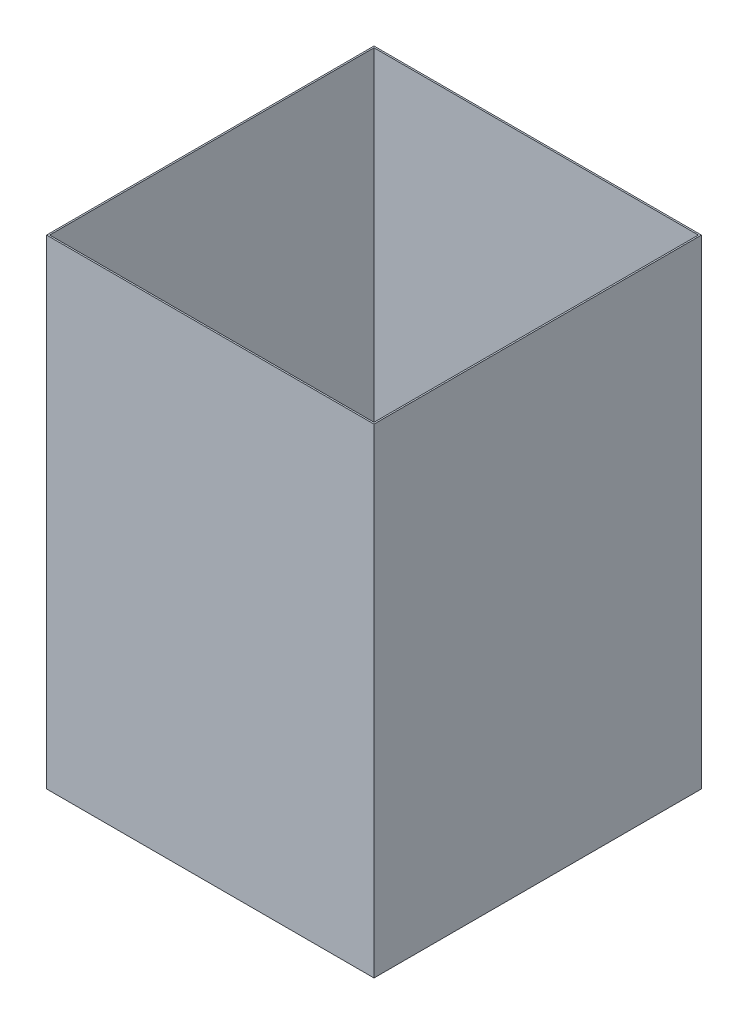
ISO-10303-21;
HEADER;
FILE_DESCRIPTION(('STEP AP214'),'2;1');
FILE_NAME('part.step','',(''),(''),'','','');
FILE_SCHEMA(('AUTOMOTIVE_DESIGN { 1 0 10303 214 1 1 1 1 }'));
ENDSEC;
DATA;
#1=APPLICATION_CONTEXT('core data for automotive mechanical design processes');
#2=APPLICATION_PROTOCOL_DEFINITION('international standard','automotive_design',2000,#1);
#3=PRODUCT_CONTEXT('',#1,'mechanical');
#4=PRODUCT('Part','Part','',(#3));
#5=PRODUCT_RELATED_PRODUCT_CATEGORY('part','',(#4));
#6=PRODUCT_DEFINITION_FORMATION('','',#4);
#7=PRODUCT_DEFINITION_CONTEXT('part definition',#1,'design');
#8=PRODUCT_DEFINITION('design','',#6,#7);
#9=PRODUCT_DEFINITION_SHAPE('','',#8);
#10=(LENGTH_UNIT() NAMED_UNIT(*) SI_UNIT(.MILLI.,.METRE.));
#11=(NAMED_UNIT(*) PLANE_ANGLE_UNIT() SI_UNIT($,.RADIAN.));
#12=(NAMED_UNIT(*) SI_UNIT($,.STERADIAN.) SOLID_ANGLE_UNIT());
#13=UNCERTAINTY_MEASURE_WITH_UNIT(LENGTH_MEASURE(1.E-05),#10,'distance_accuracy_value','');
#14=(GEOMETRIC_REPRESENTATION_CONTEXT(3) GLOBAL_UNCERTAINTY_ASSIGNED_CONTEXT((#13)) GLOBAL_UNIT_ASSIGNED_CONTEXT((#10,
#11,#12)) REPRESENTATION_CONTEXT('',''));
#15=CARTESIAN_POINT('',(0.,0.,0.));
#16=DIRECTION('',(0.,0.,1.));
#17=DIRECTION('',(1.,0.,0.));
#18=AXIS2_PLACEMENT_3D('',#15,#16,#17);
#19=CARTESIAN_POINT('',(0.,630.,0.));
#20=DIRECTION('',(0.,-1.,0.));
#21=DIRECTION('',(0.,0.,-1.));
#22=AXIS2_PLACEMENT_3D('',#19,#20,#21);
#23=PLANE('',#22);
#24=DIRECTION('',(0.,0.,-1.));
#25=VECTOR('',#24,1.);
#26=CARTESIAN_POINT('',(215.,630.,215.));
#27=LINE('',#26,#25);
#28=CARTESIAN_POINT('',(215.,630.,215.));
#29=VERTEX_POINT('',#28);
#30=CARTESIAN_POINT('',(215.,630.,-215.));
#31=VERTEX_POINT('',#30);
#32=EDGE_CURVE('E145',#29,#31,#27,.T.);
#33=ORIENTED_EDGE('',*,*,#32,.T.);
#34=DIRECTION('',(-1.,0.,0.));
#35=VECTOR('',#34,1.);
#36=CARTESIAN_POINT('',(-215.,630.,-215.));
#37=LINE('',#36,#35);
#38=CARTESIAN_POINT('',(-215.,630.,-215.));
#39=VERTEX_POINT('',#38);
#40=EDGE_CURVE('E89',#31,#39,#37,.T.);
#41=ORIENTED_EDGE('',*,*,#40,.T.);
#42=DIRECTION('',(0.,0.,1.));
#43=VECTOR('',#42,1.);
#44=CARTESIAN_POINT('',(-215.,630.,215.));
#45=LINE('',#44,#43);
#46=CARTESIAN_POINT('',(-215.,630.,215.));
#47=VERTEX_POINT('',#46);
#48=EDGE_CURVE('E148',#39,#47,#45,.T.);
#49=ORIENTED_EDGE('',*,*,#48,.T.);
#50=DIRECTION('',(1.,0.,0.));
#51=VECTOR('',#50,1.);
#52=CARTESIAN_POINT('',(-215.,630.,215.));
#53=LINE('',#52,#51);
#54=EDGE_CURVE('E61',#47,#29,#53,.T.);
#55=ORIENTED_EDGE('',*,*,#54,.T.);
#56=EDGE_LOOP('',(#33,#41,#49,#55));
#57=FACE_BOUND('',#56,.T.);
#58=DIRECTION('',(0.,0.,-1.));
#59=VECTOR('',#58,1.);
#60=CARTESIAN_POINT('',(213.,630.,0.));
#61=LINE('',#60,#59);
#62=CARTESIAN_POINT('',(213.,630.,213.));
#63=VERTEX_POINT('',#62);
#64=CARTESIAN_POINT('',(213.,630.,-213.));
#65=VERTEX_POINT('',#64);
#66=EDGE_CURVE('E134',#63,#65,#61,.T.);
#67=ORIENTED_EDGE('',*,*,#66,.F.);
#68=DIRECTION('',(1.,0.,0.));
#69=VECTOR('',#68,1.);
#70=CARTESIAN_POINT('',(0.,630.,213.));
#71=LINE('',#70,#69);
#72=CARTESIAN_POINT('',(-213.,630.,213.));
#73=VERTEX_POINT('',#72);
#74=EDGE_CURVE('E143',#73,#63,#71,.T.);
#75=ORIENTED_EDGE('',*,*,#74,.F.);
#76=DIRECTION('',(0.,0.,1.));
#77=VECTOR('',#76,1.);
#78=CARTESIAN_POINT('',(-213.,630.,0.));
#79=LINE('',#78,#77);
#80=CARTESIAN_POINT('',(-213.,630.,-213.));
#81=VERTEX_POINT('',#80);
#82=EDGE_CURVE('E141',#81,#73,#79,.T.);
#83=ORIENTED_EDGE('',*,*,#82,.F.);
#84=DIRECTION('',(-1.,0.,0.));
#85=VECTOR('',#84,1.);
#86=CARTESIAN_POINT('',(0.,630.,-213.));
#87=LINE('',#86,#85);
#88=EDGE_CURVE('E126',#65,#81,#87,.T.);
#89=ORIENTED_EDGE('',*,*,#88,.F.);
#90=EDGE_LOOP('',(#67,#75,#83,#89));
#91=FACE_BOUND('',#90,.T.);
#92=ADVANCED_FACE('F35',(#57,#91),#23,.F.);
#93=CARTESIAN_POINT('',(215.,630.,215.));
#94=DIRECTION('',(-1.,0.,0.));
#95=DIRECTION('',(0.,0.,1.));
#96=AXIS2_PLACEMENT_3D('',#93,#94,#95);
#97=PLANE('',#96);
#98=DIRECTION('',(0.,0.,-1.));
#99=VECTOR('',#98,1.);
#100=CARTESIAN_POINT('',(215.,0.,215.));
#101=LINE('',#100,#99);
#102=CARTESIAN_POINT('',(215.,0.,215.));
#103=VERTEX_POINT('',#102);
#104=CARTESIAN_POINT('',(215.,0.,-215.));
#105=VERTEX_POINT('',#104);
#106=EDGE_CURVE('E152',#103,#105,#101,.T.);
#107=ORIENTED_EDGE('',*,*,#106,.T.);
#108=DIRECTION('',(0.,-1.,0.));
#109=VECTOR('',#108,1.);
#110=CARTESIAN_POINT('',(215.,630.,-215.));
#111=LINE('',#110,#109);
#112=EDGE_CURVE('E11',#31,#105,#111,.T.);
#113=ORIENTED_EDGE('',*,*,#112,.F.);
#114=ORIENTED_EDGE('',*,*,#32,.F.);
#115=DIRECTION('',(0.,-1.,0.));
#116=VECTOR('',#115,1.);
#117=CARTESIAN_POINT('',(215.,630.,215.));
#118=LINE('',#117,#116);
#119=EDGE_CURVE('E151',#29,#103,#118,.T.);
#120=ORIENTED_EDGE('',*,*,#119,.T.);
#121=EDGE_LOOP('',(#107,#113,#114,#120));
#122=FACE_BOUND('',#121,.T.);
#123=ADVANCED_FACE('F37',(#122),#97,.F.);
#124=CARTESIAN_POINT('',(-215.,630.,-215.));
#125=DIRECTION('',(0.,0.,1.));
#126=DIRECTION('',(1.,0.,0.));
#127=AXIS2_PLACEMENT_3D('',#124,#125,#126);
#128=PLANE('',#127);
#129=DIRECTION('',(-1.,0.,0.));
#130=VECTOR('',#129,1.);
#131=CARTESIAN_POINT('',(-215.,0.,-215.));
#132=LINE('',#131,#130);
#133=CARTESIAN_POINT('',(-215.,0.,-215.));
#134=VERTEX_POINT('',#133);
#135=EDGE_CURVE('E155',#105,#134,#132,.T.);
#136=ORIENTED_EDGE('',*,*,#135,.T.);
#137=DIRECTION('',(0.,-1.,0.));
#138=VECTOR('',#137,1.);
#139=CARTESIAN_POINT('',(-215.,630.,-215.));
#140=LINE('',#139,#138);
#141=EDGE_CURVE('E44',#39,#134,#140,.T.);
#142=ORIENTED_EDGE('',*,*,#141,.F.);
#143=ORIENTED_EDGE('',*,*,#40,.F.);
#144=ORIENTED_EDGE('',*,*,#112,.T.);
#145=EDGE_LOOP('',(#136,#142,#143,#144));
#146=FACE_BOUND('',#145,.T.);
#147=ADVANCED_FACE('F228',(#146),#128,.F.);
#148=CARTESIAN_POINT('',(-215.,630.,215.));
#149=DIRECTION('',(1.,0.,0.));
#150=DIRECTION('',(0.,0.,-1.));
#151=AXIS2_PLACEMENT_3D('',#148,#149,#150);
#152=PLANE('',#151);
#153=DIRECTION('',(0.,0.,1.));
#154=VECTOR('',#153,1.);
#155=CARTESIAN_POINT('',(-215.,0.,215.));
#156=LINE('',#155,#154);
#157=CARTESIAN_POINT('',(-215.,0.,215.));
#158=VERTEX_POINT('',#157);
#159=EDGE_CURVE('E157',#134,#158,#156,.T.);
#160=ORIENTED_EDGE('',*,*,#159,.T.);
#161=DIRECTION('',(0.,-1.,0.));
#162=VECTOR('',#161,1.);
#163=CARTESIAN_POINT('',(-215.,630.,215.));
#164=LINE('',#163,#162);
#165=EDGE_CURVE('E161',#47,#158,#164,.T.);
#166=ORIENTED_EDGE('',*,*,#165,.F.);
#167=ORIENTED_EDGE('',*,*,#48,.F.);
#168=ORIENTED_EDGE('',*,*,#141,.T.);
#169=EDGE_LOOP('',(#160,#166,#167,#168));
#170=FACE_BOUND('',#169,.T.);
#171=ADVANCED_FACE('F240',(#170),#152,.F.);
#172=CARTESIAN_POINT('',(-215.,630.,215.));
#173=DIRECTION('',(0.,0.,-1.));
#174=DIRECTION('',(-1.,0.,0.));
#175=AXIS2_PLACEMENT_3D('',#172,#173,#174);
#176=PLANE('',#175);
#177=DIRECTION('',(1.,0.,0.));
#178=VECTOR('',#177,1.);
#179=CARTESIAN_POINT('',(-215.,0.,215.));
#180=LINE('',#179,#178);
#181=EDGE_CURVE('E82',#158,#103,#180,.T.);
#182=ORIENTED_EDGE('',*,*,#181,.T.);
#183=ORIENTED_EDGE('',*,*,#119,.F.);
#184=ORIENTED_EDGE('',*,*,#54,.F.);
#185=ORIENTED_EDGE('',*,*,#165,.T.);
#186=EDGE_LOOP('',(#182,#183,#184,#185));
#187=FACE_BOUND('',#186,.T.);
#188=ADVANCED_FACE('F236',(#187),#176,.F.);
#189=CARTESIAN_POINT('',(0.,0.,0.));
#190=DIRECTION('',(0.,-1.,0.));
#191=DIRECTION('',(0.,0.,-1.));
#192=AXIS2_PLACEMENT_3D('',#189,#190,#191);
#193=PLANE('',#192);
#194=CARTESIAN_POINT('',(-142.1,0.,133.));
#195=DIRECTION('',(0.,-1.,0.));
#196=DIRECTION('',(0.,0.,-1.));
#197=AXIS2_PLACEMENT_3D('',#194,#195,#196);
#198=CIRCLE('',#197,5.00000000000002);
#199=CARTESIAN_POINT('',(-142.1,0.,128.));
#200=VERTEX_POINT('',#199);
#201=EDGE_CURVE('E200',#200,#200,#198,.T.);
#202=ORIENTED_EDGE('',*,*,#201,.F.);
#203=EDGE_LOOP('',(#202));
#204=FACE_BOUND('',#203,.T.);
#205=CARTESIAN_POINT('',(-165.,0.,133.));
#206=DIRECTION('',(0.,-1.,0.));
#207=DIRECTION('',(0.,0.,-1.));
#208=AXIS2_PLACEMENT_3D('',#205,#206,#207);
#209=CIRCLE('',#208,4.99999999999999);
#210=CARTESIAN_POINT('',(-165.,0.,128.));
#211=VERTEX_POINT('',#210);
#212=EDGE_CURVE('E190',#211,#211,#209,.T.);
#213=ORIENTED_EDGE('',*,*,#212,.F.);
#214=EDGE_LOOP('',(#213));
#215=FACE_BOUND('',#214,.T.);
#216=CARTESIAN_POINT('',(140.1,0.,135.));
#217=DIRECTION('',(0.,-1.,0.));
#218=DIRECTION('',(0.,0.,-1.));
#219=AXIS2_PLACEMENT_3D('',#216,#217,#218);
#220=CIRCLE('',#219,5.00000000000002);
#221=CARTESIAN_POINT('',(140.1,0.,130.));
#222=VERTEX_POINT('',#221);
#223=EDGE_CURVE('E187',#222,#222,#220,.T.);
#224=ORIENTED_EDGE('',*,*,#223,.F.);
#225=EDGE_LOOP('',(#224));
#226=FACE_BOUND('',#225,.T.);
#227=CARTESIAN_POINT('',(163.,0.,135.));
#228=DIRECTION('',(0.,-1.,0.));
#229=DIRECTION('',(0.,0.,-1.));
#230=AXIS2_PLACEMENT_3D('',#227,#228,#229);
#231=CIRCLE('',#230,4.99999999999999);
#232=CARTESIAN_POINT('',(163.,0.,130.));
#233=VERTEX_POINT('',#232);
#234=EDGE_CURVE('E184',#233,#233,#231,.T.);
#235=ORIENTED_EDGE('',*,*,#234,.F.);
#236=EDGE_LOOP('',(#235));
#237=FACE_BOUND('',#236,.T.);
#238=CARTESIAN_POINT('',(142.1,0.,-135.));
#239=DIRECTION('',(0.,-1.,0.));
#240=DIRECTION('',(0.,0.,-1.));
#241=AXIS2_PLACEMENT_3D('',#238,#239,#240);
#242=CIRCLE('',#241,5.00000000000002);
#243=CARTESIAN_POINT('',(142.1,0.,-140.));
#244=VERTEX_POINT('',#243);
#245=EDGE_CURVE('E180',#244,#244,#242,.T.);
#246=ORIENTED_EDGE('',*,*,#245,.F.);
#247=EDGE_LOOP('',(#246));
#248=FACE_BOUND('',#247,.T.);
#249=CARTESIAN_POINT('',(165.,0.,-135.));
#250=DIRECTION('',(0.,-1.,0.));
#251=DIRECTION('',(0.,0.,-1.));
#252=AXIS2_PLACEMENT_3D('',#249,#250,#251);
#253=CIRCLE('',#252,4.99999999999999);
#254=CARTESIAN_POINT('',(165.,0.,-140.));
#255=VERTEX_POINT('',#254);
#256=EDGE_CURVE('E176',#255,#255,#253,.T.);
#257=ORIENTED_EDGE('',*,*,#256,.F.);
#258=EDGE_LOOP('',(#257));
#259=FACE_BOUND('',#258,.T.);
#260=CARTESIAN_POINT('',(-142.1,0.,-135.));
#261=DIRECTION('',(0.,-1.,0.));
#262=DIRECTION('',(0.,0.,-1.));
#263=AXIS2_PLACEMENT_3D('',#260,#261,#262);
#264=CIRCLE('',#263,5.00000000000002);
#265=CARTESIAN_POINT('',(-142.1,0.,-140.));
#266=VERTEX_POINT('',#265);
#267=EDGE_CURVE('E172',#266,#266,#264,.T.);
#268=ORIENTED_EDGE('',*,*,#267,.F.);
#269=EDGE_LOOP('',(#268));
#270=FACE_BOUND('',#269,.T.);
#271=CARTESIAN_POINT('',(-165.,0.,-135.));
#272=DIRECTION('',(0.,-1.,0.));
#273=DIRECTION('',(0.,0.,-1.));
#274=AXIS2_PLACEMENT_3D('',#271,#272,#273);
#275=CIRCLE('',#274,4.99999999999999);
#276=CARTESIAN_POINT('',(-165.,0.,-140.));
#277=VERTEX_POINT('',#276);
#278=EDGE_CURVE('E168',#277,#277,#275,.T.);
#279=ORIENTED_EDGE('',*,*,#278,.F.);
#280=EDGE_LOOP('',(#279));
#281=FACE_BOUND('',#280,.T.);
#282=ORIENTED_EDGE('',*,*,#106,.F.);
#283=ORIENTED_EDGE('',*,*,#181,.F.);
#284=ORIENTED_EDGE('',*,*,#159,.F.);
#285=ORIENTED_EDGE('',*,*,#135,.F.);
#286=EDGE_LOOP('',(#282,#283,#284,#285));
#287=FACE_BOUND('',#286,.T.);
#288=ADVANCED_FACE('F233',(#204,#215,#226,#237,#248,#259,#270,#281,#287),#193,.T.);
#289=CARTESIAN_POINT('',(213.,630.,215.));
#290=DIRECTION('',(-1.,0.,0.));
#291=DIRECTION('',(0.,0.,1.));
#292=AXIS2_PLACEMENT_3D('',#289,#290,#291);
#293=PLANE('',#292);
#294=DIRECTION('',(0.,0.,-1.));
#295=VECTOR('',#294,1.);
#296=CARTESIAN_POINT('',(213.,2.,0.));
#297=LINE('',#296,#295);
#298=CARTESIAN_POINT('',(213.,2.,213.));
#299=VERTEX_POINT('',#298);
#300=CARTESIAN_POINT('',(213.,2.,-213.));
#301=VERTEX_POINT('',#300);
#302=EDGE_CURVE('E117',#299,#301,#297,.T.);
#303=ORIENTED_EDGE('',*,*,#302,.F.);
#304=DIRECTION('',(0.,-1.,0.));
#305=VECTOR('',#304,1.);
#306=CARTESIAN_POINT('',(213.,630.,213.));
#307=LINE('',#306,#305);
#308=EDGE_CURVE('E137',#63,#299,#307,.T.);
#309=ORIENTED_EDGE('',*,*,#308,.F.);
#310=ORIENTED_EDGE('',*,*,#66,.T.);
#311=DIRECTION('',(0.,-1.,0.));
#312=VECTOR('',#311,1.);
#313=CARTESIAN_POINT('',(213.,630.,-213.));
#314=LINE('',#313,#312);
#315=EDGE_CURVE('E129',#65,#301,#314,.T.);
#316=ORIENTED_EDGE('',*,*,#315,.T.);
#317=EDGE_LOOP('',(#303,#309,#310,#316));
#318=FACE_BOUND('',#317,.T.);
#319=ADVANCED_FACE('F221',(#318),#293,.T.);
#320=CARTESIAN_POINT('',(-215.,630.,-213.));
#321=DIRECTION('',(0.,0.,1.));
#322=DIRECTION('',(1.,0.,0.));
#323=AXIS2_PLACEMENT_3D('',#320,#321,#322);
#324=PLANE('',#323);
#325=DIRECTION('',(-1.,0.,0.));
#326=VECTOR('',#325,1.);
#327=CARTESIAN_POINT('',(0.,2.,-213.));
#328=LINE('',#327,#326);
#329=CARTESIAN_POINT('',(-213.,2.,-213.));
#330=VERTEX_POINT('',#329);
#331=EDGE_CURVE('E111',#301,#330,#328,.T.);
#332=ORIENTED_EDGE('',*,*,#331,.F.);
#333=ORIENTED_EDGE('',*,*,#315,.F.);
#334=ORIENTED_EDGE('',*,*,#88,.T.);
#335=DIRECTION('',(0.,-1.,0.));
#336=VECTOR('',#335,1.);
#337=CARTESIAN_POINT('',(-213.,630.,-213.));
#338=LINE('',#337,#336);
#339=EDGE_CURVE('E123',#81,#330,#338,.T.);
#340=ORIENTED_EDGE('',*,*,#339,.T.);
#341=EDGE_LOOP('',(#332,#333,#334,#340));
#342=FACE_BOUND('',#341,.T.);
#343=ADVANCED_FACE('F124',(#342),#324,.T.);
#344=CARTESIAN_POINT('',(-213.,630.,215.));
#345=DIRECTION('',(1.,0.,0.));
#346=DIRECTION('',(0.,0.,-1.));
#347=AXIS2_PLACEMENT_3D('',#344,#345,#346);
#348=PLANE('',#347);
#349=DIRECTION('',(0.,0.,1.));
#350=VECTOR('',#349,1.);
#351=CARTESIAN_POINT('',(-213.,2.,0.));
#352=LINE('',#351,#350);
#353=CARTESIAN_POINT('',(-213.,2.,213.));
#354=VERTEX_POINT('',#353);
#355=EDGE_CURVE('E115',#330,#354,#352,.T.);
#356=ORIENTED_EDGE('',*,*,#355,.F.);
#357=ORIENTED_EDGE('',*,*,#339,.F.);
#358=ORIENTED_EDGE('',*,*,#82,.T.);
#359=DIRECTION('',(0.,-1.,0.));
#360=VECTOR('',#359,1.);
#361=CARTESIAN_POINT('',(-213.,630.,213.));
#362=LINE('',#361,#360);
#363=EDGE_CURVE('E52',#73,#354,#362,.T.);
#364=ORIENTED_EDGE('',*,*,#363,.T.);
#365=EDGE_LOOP('',(#356,#357,#358,#364));
#366=FACE_BOUND('',#365,.T.);
#367=ADVANCED_FACE('F131',(#366),#348,.T.);
#368=CARTESIAN_POINT('',(-215.,630.,213.));
#369=DIRECTION('',(0.,0.,-1.));
#370=DIRECTION('',(-1.,0.,0.));
#371=AXIS2_PLACEMENT_3D('',#368,#369,#370);
#372=PLANE('',#371);
#373=DIRECTION('',(1.,0.,0.));
#374=VECTOR('',#373,1.);
#375=CARTESIAN_POINT('',(0.,2.,213.));
#376=LINE('',#375,#374);
#377=EDGE_CURVE('E132',#354,#299,#376,.T.);
#378=ORIENTED_EDGE('',*,*,#377,.F.);
#379=ORIENTED_EDGE('',*,*,#363,.F.);
#380=ORIENTED_EDGE('',*,*,#74,.T.);
#381=ORIENTED_EDGE('',*,*,#308,.T.);
#382=EDGE_LOOP('',(#378,#379,#380,#381));
#383=FACE_BOUND('',#382,.T.);
#384=ADVANCED_FACE('F217',(#383),#372,.T.);
#385=CARTESIAN_POINT('',(0.,2.,0.));
#386=DIRECTION('',(0.,-1.,0.));
#387=DIRECTION('',(0.,0.,-1.));
#388=AXIS2_PLACEMENT_3D('',#385,#386,#387);
#389=PLANE('',#388);
#390=CARTESIAN_POINT('',(-142.1,2.,133.));
#391=DIRECTION('',(0.,-1.,0.));
#392=DIRECTION('',(0.,0.,-1.));
#393=AXIS2_PLACEMENT_3D('',#390,#391,#392);
#394=CIRCLE('',#393,5.00000000000002);
#395=CARTESIAN_POINT('',(-142.1,2.,128.));
#396=VERTEX_POINT('',#395);
#397=EDGE_CURVE('E39',#396,#396,#394,.T.);
#398=ORIENTED_EDGE('',*,*,#397,.T.);
#399=EDGE_LOOP('',(#398));
#400=FACE_BOUND('',#399,.T.);
#401=CARTESIAN_POINT('',(-165.,2.,133.));
#402=DIRECTION('',(0.,-1.,0.));
#403=DIRECTION('',(0.,0.,-1.));
#404=AXIS2_PLACEMENT_3D('',#401,#402,#403);
#405=CIRCLE('',#404,4.99999999999999);
#406=CARTESIAN_POINT('',(-165.,2.,128.));
#407=VERTEX_POINT('',#406);
#408=EDGE_CURVE('E188',#407,#407,#405,.T.);
#409=ORIENTED_EDGE('',*,*,#408,.T.);
#410=EDGE_LOOP('',(#409));
#411=FACE_BOUND('',#410,.T.);
#412=CARTESIAN_POINT('',(140.1,2.,135.));
#413=DIRECTION('',(0.,-1.,0.));
#414=DIRECTION('',(0.,0.,-1.));
#415=AXIS2_PLACEMENT_3D('',#412,#413,#414);
#416=CIRCLE('',#415,5.00000000000002);
#417=CARTESIAN_POINT('',(140.1,2.,130.));
#418=VERTEX_POINT('',#417);
#419=EDGE_CURVE('E185',#418,#418,#416,.T.);
#420=ORIENTED_EDGE('',*,*,#419,.T.);
#421=EDGE_LOOP('',(#420));
#422=FACE_BOUND('',#421,.T.);
#423=CARTESIAN_POINT('',(163.,2.,135.));
#424=DIRECTION('',(0.,-1.,0.));
#425=DIRECTION('',(0.,0.,-1.));
#426=AXIS2_PLACEMENT_3D('',#423,#424,#425);
#427=CIRCLE('',#426,4.99999999999999);
#428=CARTESIAN_POINT('',(163.,2.,130.));
#429=VERTEX_POINT('',#428);
#430=EDGE_CURVE('E181',#429,#429,#427,.T.);
#431=ORIENTED_EDGE('',*,*,#430,.T.);
#432=EDGE_LOOP('',(#431));
#433=FACE_BOUND('',#432,.T.);
#434=CARTESIAN_POINT('',(142.1,2.,-135.));
#435=DIRECTION('',(0.,-1.,0.));
#436=DIRECTION('',(0.,0.,-1.));
#437=AXIS2_PLACEMENT_3D('',#434,#435,#436);
#438=CIRCLE('',#437,5.00000000000002);
#439=CARTESIAN_POINT('',(142.1,2.,-140.));
#440=VERTEX_POINT('',#439);
#441=EDGE_CURVE('E177',#440,#440,#438,.T.);
#442=ORIENTED_EDGE('',*,*,#441,.T.);
#443=EDGE_LOOP('',(#442));
#444=FACE_BOUND('',#443,.T.);
#445=CARTESIAN_POINT('',(165.,2.,-135.));
#446=DIRECTION('',(0.,-1.,0.));
#447=DIRECTION('',(0.,0.,-1.));
#448=AXIS2_PLACEMENT_3D('',#445,#446,#447);
#449=CIRCLE('',#448,4.99999999999999);
#450=CARTESIAN_POINT('',(165.,2.,-140.));
#451=VERTEX_POINT('',#450);
#452=EDGE_CURVE('E173',#451,#451,#449,.T.);
#453=ORIENTED_EDGE('',*,*,#452,.T.);
#454=EDGE_LOOP('',(#453));
#455=FACE_BOUND('',#454,.T.);
#456=CARTESIAN_POINT('',(-142.1,2.,-135.));
#457=DIRECTION('',(0.,-1.,0.));
#458=DIRECTION('',(0.,0.,-1.));
#459=AXIS2_PLACEMENT_3D('',#456,#457,#458);
#460=CIRCLE('',#459,5.00000000000002);
#461=CARTESIAN_POINT('',(-142.1,2.,-140.));
#462=VERTEX_POINT('',#461);
#463=EDGE_CURVE('E169',#462,#462,#460,.T.);
#464=ORIENTED_EDGE('',*,*,#463,.T.);
#465=EDGE_LOOP('',(#464));
#466=FACE_BOUND('',#465,.T.);
#467=CARTESIAN_POINT('',(-165.,2.,-135.));
#468=DIRECTION('',(0.,-1.,0.));
#469=DIRECTION('',(0.,0.,-1.));
#470=AXIS2_PLACEMENT_3D('',#467,#468,#469);
#471=CIRCLE('',#470,4.99999999999999);
#472=CARTESIAN_POINT('',(-165.,2.,-140.));
#473=VERTEX_POINT('',#472);
#474=EDGE_CURVE('E165',#473,#473,#471,.T.);
#475=ORIENTED_EDGE('',*,*,#474,.T.);
#476=EDGE_LOOP('',(#475));
#477=FACE_BOUND('',#476,.T.);
#478=ORIENTED_EDGE('',*,*,#302,.T.);
#479=ORIENTED_EDGE('',*,*,#331,.T.);
#480=ORIENTED_EDGE('',*,*,#355,.T.);
#481=ORIENTED_EDGE('',*,*,#377,.T.);
#482=EDGE_LOOP('',(#478,#479,#480,#481));
#483=FACE_BOUND('',#482,.T.);
#484=ADVANCED_FACE('F113',(#400,#411,#422,#433,#444,#455,#466,#477,#483),#389,.F.);
#485=CARTESIAN_POINT('',(-165.,10.,-135.));
#486=DIRECTION('',(0.,-1.,0.));
#487=DIRECTION('',(0.,0.,-1.));
#488=AXIS2_PLACEMENT_3D('',#485,#486,#487);
#489=CYLINDRICAL_SURFACE('',#488,4.99999999999999);
#490=ORIENTED_EDGE('',*,*,#278,.T.);
#491=EDGE_LOOP('',(#490));
#492=FACE_BOUND('',#491,.T.);
#493=ORIENTED_EDGE('',*,*,#474,.F.);
#494=EDGE_LOOP('',(#493));
#495=FACE_BOUND('',#494,.T.);
#496=ADVANCED_FACE('F298',(#492,#495),#489,.F.);
#497=CARTESIAN_POINT('',(-142.1,10.,-135.));
#498=DIRECTION('',(0.,-1.,0.));
#499=DIRECTION('',(0.,0.,-1.));
#500=AXIS2_PLACEMENT_3D('',#497,#498,#499);
#501=CYLINDRICAL_SURFACE('',#500,5.00000000000002);
#502=ORIENTED_EDGE('',*,*,#267,.T.);
#503=EDGE_LOOP('',(#502));
#504=FACE_BOUND('',#503,.T.);
#505=ORIENTED_EDGE('',*,*,#463,.F.);
#506=EDGE_LOOP('',(#505));
#507=FACE_BOUND('',#506,.T.);
#508=ADVANCED_FACE('F305',(#504,#507),#501,.F.);
#509=CARTESIAN_POINT('',(165.,10.,-135.));
#510=DIRECTION('',(0.,-1.,0.));
#511=DIRECTION('',(0.,0.,-1.));
#512=AXIS2_PLACEMENT_3D('',#509,#510,#511);
#513=CYLINDRICAL_SURFACE('',#512,4.99999999999999);
#514=ORIENTED_EDGE('',*,*,#256,.T.);
#515=EDGE_LOOP('',(#514));
#516=FACE_BOUND('',#515,.T.);
#517=ORIENTED_EDGE('',*,*,#452,.F.);
#518=EDGE_LOOP('',(#517));
#519=FACE_BOUND('',#518,.T.);
#520=ADVANCED_FACE('F313',(#516,#519),#513,.F.);
#521=CARTESIAN_POINT('',(142.1,10.,-135.));
#522=DIRECTION('',(0.,-1.,0.));
#523=DIRECTION('',(0.,0.,-1.));
#524=AXIS2_PLACEMENT_3D('',#521,#522,#523);
#525=CYLINDRICAL_SURFACE('',#524,5.00000000000002);
#526=ORIENTED_EDGE('',*,*,#245,.T.);
#527=EDGE_LOOP('',(#526));
#528=FACE_BOUND('',#527,.T.);
#529=ORIENTED_EDGE('',*,*,#441,.F.);
#530=EDGE_LOOP('',(#529));
#531=FACE_BOUND('',#530,.T.);
#532=ADVANCED_FACE('F321',(#528,#531),#525,.F.);
#533=CARTESIAN_POINT('',(163.,10.,135.));
#534=DIRECTION('',(0.,-1.,0.));
#535=DIRECTION('',(0.,0.,-1.));
#536=AXIS2_PLACEMENT_3D('',#533,#534,#535);
#537=CYLINDRICAL_SURFACE('',#536,4.99999999999999);
#538=ORIENTED_EDGE('',*,*,#234,.T.);
#539=EDGE_LOOP('',(#538));
#540=FACE_BOUND('',#539,.T.);
#541=ORIENTED_EDGE('',*,*,#430,.F.);
#542=EDGE_LOOP('',(#541));
#543=FACE_BOUND('',#542,.T.);
#544=ADVANCED_FACE('F329',(#540,#543),#537,.F.);
#545=CARTESIAN_POINT('',(140.1,10.,135.));
#546=DIRECTION('',(0.,-1.,0.));
#547=DIRECTION('',(0.,0.,-1.));
#548=AXIS2_PLACEMENT_3D('',#545,#546,#547);
#549=CYLINDRICAL_SURFACE('',#548,5.00000000000002);
#550=ORIENTED_EDGE('',*,*,#223,.T.);
#551=EDGE_LOOP('',(#550));
#552=FACE_BOUND('',#551,.T.);
#553=ORIENTED_EDGE('',*,*,#419,.F.);
#554=EDGE_LOOP('',(#553));
#555=FACE_BOUND('',#554,.T.);
#556=ADVANCED_FACE('F337',(#552,#555),#549,.F.);
#557=CARTESIAN_POINT('',(-165.,10.,133.));
#558=DIRECTION('',(0.,-1.,0.));
#559=DIRECTION('',(0.,0.,-1.));
#560=AXIS2_PLACEMENT_3D('',#557,#558,#559);
#561=CYLINDRICAL_SURFACE('',#560,4.99999999999999);
#562=ORIENTED_EDGE('',*,*,#212,.T.);
#563=EDGE_LOOP('',(#562));
#564=FACE_BOUND('',#563,.T.);
#565=ORIENTED_EDGE('',*,*,#408,.F.);
#566=EDGE_LOOP('',(#565));
#567=FACE_BOUND('',#566,.T.);
#568=ADVANCED_FACE('F345',(#564,#567),#561,.F.);
#569=CARTESIAN_POINT('',(-142.1,10.,133.));
#570=DIRECTION('',(0.,-1.,0.));
#571=DIRECTION('',(0.,0.,-1.));
#572=AXIS2_PLACEMENT_3D('',#569,#570,#571);
#573=CYLINDRICAL_SURFACE('',#572,5.00000000000002);
#574=ORIENTED_EDGE('',*,*,#201,.T.);
#575=EDGE_LOOP('',(#574));
#576=FACE_BOUND('',#575,.T.);
#577=ORIENTED_EDGE('',*,*,#397,.F.);
#578=EDGE_LOOP('',(#577));
#579=FACE_BOUND('',#578,.T.);
#580=ADVANCED_FACE('F352',(#576,#579),#573,.F.);
#581=CLOSED_SHELL('',(#92,#123,#147,#171,#188,#288,#319,#343,#367,#384,#484,#496,#508,#520,#532,
#544,#556,#568,#580));
#582=MANIFOLD_SOLID_BREP('B2',#581);
#583=ADVANCED_BREP_SHAPE_REPRESENTATION('',(#18,#582),#14);
#584=SHAPE_DEFINITION_REPRESENTATION(#9,#583);
ENDSEC;
END-ISO-10303-21;
